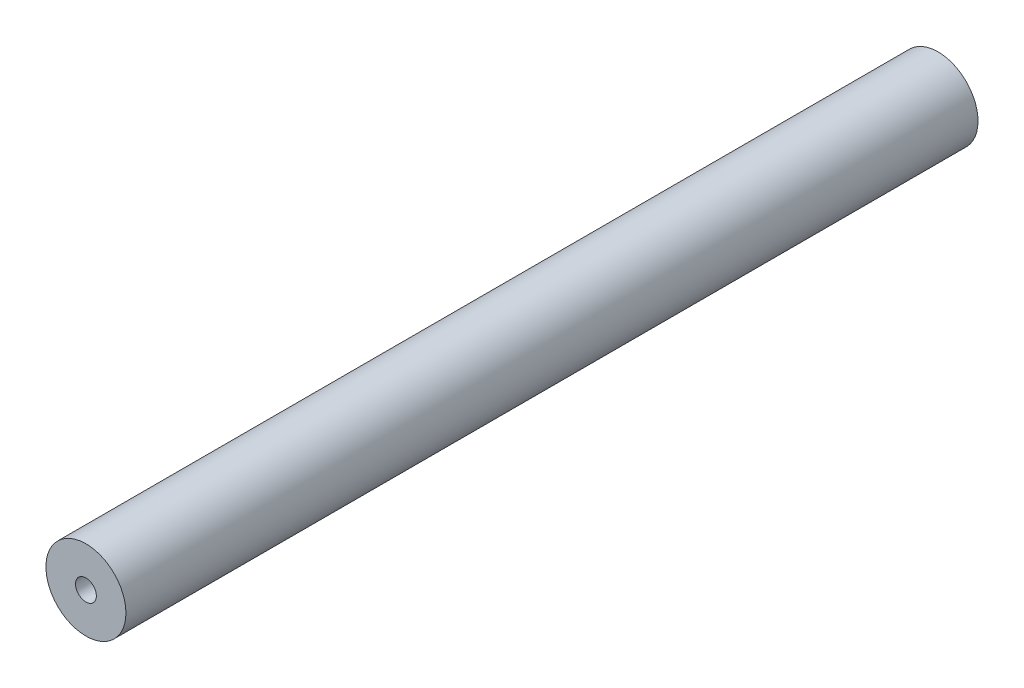
ISO-10303-21;
HEADER;
FILE_DESCRIPTION(('STEP AP214'),'2;1');
FILE_NAME('part.step','',(''),(''),'','','');
FILE_SCHEMA(('AUTOMOTIVE_DESIGN { 1 0 10303 214 1 1 1 1 }'));
ENDSEC;
DATA;
#1=APPLICATION_CONTEXT('core data for automotive mechanical design processes');
#2=APPLICATION_PROTOCOL_DEFINITION('international standard','automotive_design',2000,#1);
#3=PRODUCT_CONTEXT('',#1,'mechanical');
#4=PRODUCT('Part','Part','',(#3));
#5=PRODUCT_RELATED_PRODUCT_CATEGORY('part','',(#4));
#6=PRODUCT_DEFINITION_FORMATION('','',#4);
#7=PRODUCT_DEFINITION_CONTEXT('part definition',#1,'design');
#8=PRODUCT_DEFINITION('design','',#6,#7);
#9=PRODUCT_DEFINITION_SHAPE('','',#8);
#10=(LENGTH_UNIT() NAMED_UNIT(*) SI_UNIT(.MILLI.,.METRE.));
#11=(NAMED_UNIT(*) PLANE_ANGLE_UNIT() SI_UNIT($,.RADIAN.));
#12=(NAMED_UNIT(*) SI_UNIT($,.STERADIAN.) SOLID_ANGLE_UNIT());
#13=UNCERTAINTY_MEASURE_WITH_UNIT(LENGTH_MEASURE(1.E-05),#10,'distance_accuracy_value','');
#14=(GEOMETRIC_REPRESENTATION_CONTEXT(3) GLOBAL_UNCERTAINTY_ASSIGNED_CONTEXT((#13)) GLOBAL_UNIT_ASSIGNED_CONTEXT((#10,
#11,#12)) REPRESENTATION_CONTEXT('',''));
#15=CARTESIAN_POINT('',(0.,0.,0.));
#16=DIRECTION('',(0.,0.,1.));
#17=DIRECTION('',(1.,0.,0.));
#18=AXIS2_PLACEMENT_3D('',#15,#16,#17);
#19=CARTESIAN_POINT('',(0.,0.,1347.5));
#20=DIRECTION('',(0.,0.,1.));
#21=DIRECTION('',(1.,0.,0.));
#22=AXIS2_PLACEMENT_3D('',#19,#20,#21);
#23=PLANE('',#22);
#24=CARTESIAN_POINT('',(0.,0.,1347.5));
#25=DIRECTION('',(0.,0.,1.));
#26=DIRECTION('',(1.,0.,0.));
#27=AXIS2_PLACEMENT_3D('',#24,#25,#26);
#28=CIRCLE('',#27,11.5);
#29=CARTESIAN_POINT('',(11.5,0.,1347.5));
#30=VERTEX_POINT('',#29);
#31=EDGE_CURVE('E10',#30,#30,#28,.T.);
#32=ORIENTED_EDGE('',*,*,#31,.T.);
#33=EDGE_LOOP('',(#32));
#34=FACE_BOUND('',#33,.T.);
#35=CARTESIAN_POINT('',(0.,0.,1347.5));
#36=DIRECTION('',(0.,0.,1.));
#37=DIRECTION('',(1.,0.,0.));
#38=AXIS2_PLACEMENT_3D('',#35,#36,#37);
#39=CIRCLE('',#38,3.);
#40=CARTESIAN_POINT('',(3.,0.,1347.5));
#41=VERTEX_POINT('',#40);
#42=EDGE_CURVE('E52',#41,#41,#39,.T.);
#43=ORIENTED_EDGE('',*,*,#42,.F.);
#44=EDGE_LOOP('',(#43));
#45=FACE_BOUND('',#44,.T.);
#46=ADVANCED_FACE('F41',(#34,#45),#23,.T.);
#47=CARTESIAN_POINT('',(0.,0.,1102.5));
#48=DIRECTION('',(0.,0.,1.));
#49=DIRECTION('',(1.,0.,0.));
#50=AXIS2_PLACEMENT_3D('',#47,#48,#49);
#51=PLANE('',#50);
#52=CARTESIAN_POINT('',(0.,0.,1102.5));
#53=DIRECTION('',(0.,0.,1.));
#54=DIRECTION('',(1.,0.,0.));
#55=AXIS2_PLACEMENT_3D('',#52,#53,#54);
#56=CIRCLE('',#55,11.5);
#57=CARTESIAN_POINT('',(11.5,0.,1102.5));
#58=VERTEX_POINT('',#57);
#59=EDGE_CURVE('E45',#58,#58,#56,.T.);
#60=ORIENTED_EDGE('',*,*,#59,.F.);
#61=EDGE_LOOP('',(#60));
#62=FACE_BOUND('',#61,.T.);
#63=CARTESIAN_POINT('',(0.,0.,1102.5));
#64=DIRECTION('',(0.,0.,1.));
#65=DIRECTION('',(1.,0.,0.));
#66=AXIS2_PLACEMENT_3D('',#63,#64,#65);
#67=CIRCLE('',#66,3.);
#68=CARTESIAN_POINT('',(3.,0.,1102.5));
#69=VERTEX_POINT('',#68);
#70=EDGE_CURVE('E54',#69,#69,#67,.T.);
#71=ORIENTED_EDGE('',*,*,#70,.T.);
#72=EDGE_LOOP('',(#71));
#73=FACE_BOUND('',#72,.T.);
#74=ADVANCED_FACE('F64',(#62,#73),#51,.F.);
#75=CARTESIAN_POINT('',(0.,0.,1347.5));
#76=DIRECTION('',(0.,0.,-1.));
#77=DIRECTION('',(-1.,0.,0.));
#78=AXIS2_PLACEMENT_3D('',#75,#76,#77);
#79=CYLINDRICAL_SURFACE('',#78,11.5);
#80=ORIENTED_EDGE('',*,*,#31,.F.);
#81=EDGE_LOOP('',(#80));
#82=FACE_BOUND('',#81,.T.);
#83=ORIENTED_EDGE('',*,*,#59,.T.);
#84=EDGE_LOOP('',(#83));
#85=FACE_BOUND('',#84,.T.);
#86=ADVANCED_FACE('F43',(#82,#85),#79,.T.);
#87=CARTESIAN_POINT('',(0.,0.,1347.5));
#88=DIRECTION('',(0.,0.,-1.));
#89=DIRECTION('',(-1.,0.,0.));
#90=AXIS2_PLACEMENT_3D('',#87,#88,#89);
#91=CYLINDRICAL_SURFACE('',#90,3.);
#92=ORIENTED_EDGE('',*,*,#42,.T.);
#93=EDGE_LOOP('',(#92));
#94=FACE_BOUND('',#93,.T.);
#95=ORIENTED_EDGE('',*,*,#70,.F.);
#96=EDGE_LOOP('',(#95));
#97=FACE_BOUND('',#96,.T.);
#98=ADVANCED_FACE('F60',(#94,#97),#91,.F.);
#99=CLOSED_SHELL('',(#46,#74,#86,#98));
#100=MANIFOLD_SOLID_BREP('B2',#99);
#101=ADVANCED_BREP_SHAPE_REPRESENTATION('',(#18,#100),#14);
#102=SHAPE_DEFINITION_REPRESENTATION(#9,#101);
ENDSEC;
END-ISO-10303-21;
